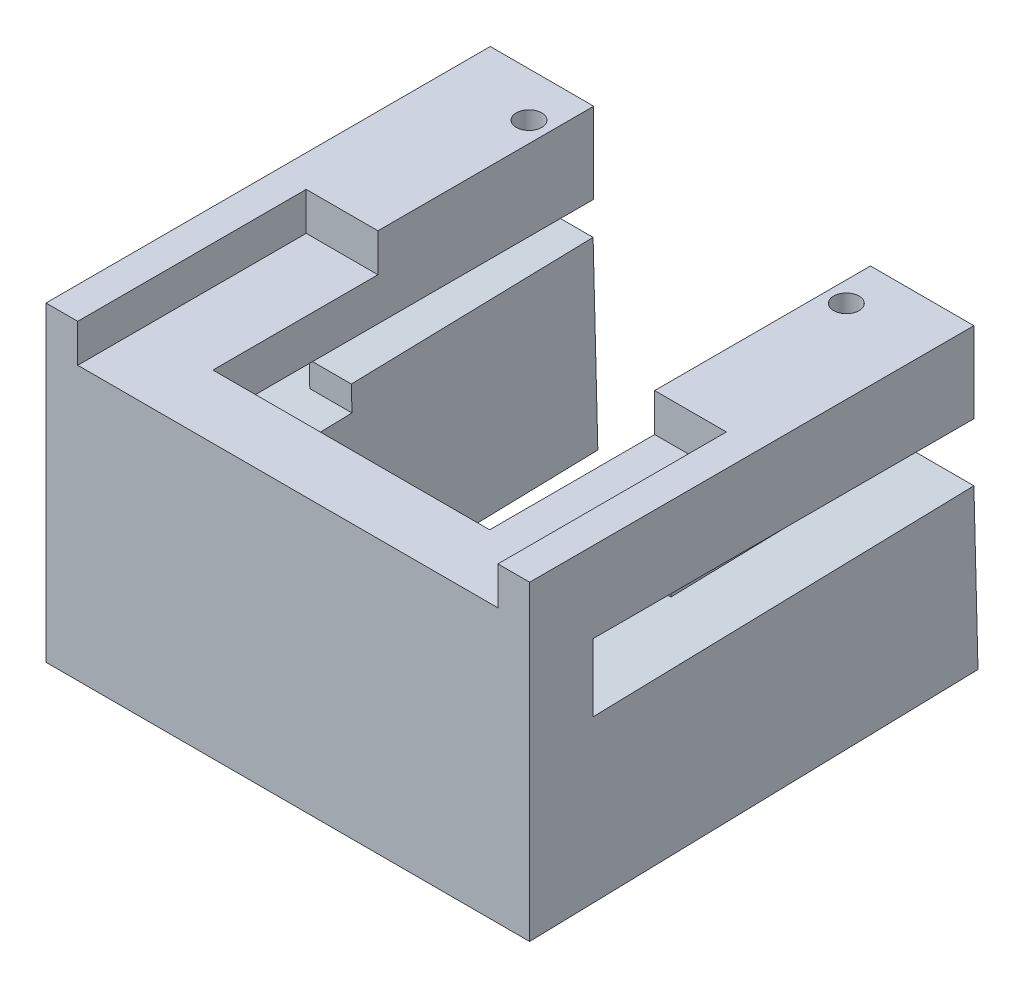
ISO-10303-21;
HEADER;
FILE_DESCRIPTION(('STEP AP214'),'2;1');
FILE_NAME('part.step','',(''),(''),'','','');
FILE_SCHEMA(('AUTOMOTIVE_DESIGN { 1 0 10303 214 1 1 1 1 }'));
ENDSEC;
DATA;
#1=APPLICATION_CONTEXT('core data for automotive mechanical design processes');
#2=APPLICATION_PROTOCOL_DEFINITION('international standard','automotive_design',2000,#1);
#3=PRODUCT_CONTEXT('',#1,'mechanical');
#4=PRODUCT('Part','Part','',(#3));
#5=PRODUCT_RELATED_PRODUCT_CATEGORY('part','',(#4));
#6=PRODUCT_DEFINITION_FORMATION('','',#4);
#7=PRODUCT_DEFINITION_CONTEXT('part definition',#1,'design');
#8=PRODUCT_DEFINITION('design','',#6,#7);
#9=PRODUCT_DEFINITION_SHAPE('','',#8);
#10=(LENGTH_UNIT() NAMED_UNIT(*) SI_UNIT(.MILLI.,.METRE.));
#11=(NAMED_UNIT(*) PLANE_ANGLE_UNIT() SI_UNIT($,.RADIAN.));
#12=(NAMED_UNIT(*) SI_UNIT($,.STERADIAN.) SOLID_ANGLE_UNIT());
#13=UNCERTAINTY_MEASURE_WITH_UNIT(LENGTH_MEASURE(1.E-05),#10,'distance_accuracy_value','');
#14=(GEOMETRIC_REPRESENTATION_CONTEXT(3) GLOBAL_UNCERTAINTY_ASSIGNED_CONTEXT((#13)) GLOBAL_UNIT_ASSIGNED_CONTEXT((#10,
#11,#12)) REPRESENTATION_CONTEXT('',''));
#15=CARTESIAN_POINT('',(0.,0.,0.));
#16=DIRECTION('',(0.,0.,1.));
#17=DIRECTION('',(1.,0.,0.));
#18=AXIS2_PLACEMENT_3D('',#15,#16,#17);
#19=CARTESIAN_POINT('',(19.05,7.40598079101419,0.));
#20=DIRECTION('',(0.,-1.,0.));
#21=DIRECTION('',(0.,0.,-1.));
#22=AXIS2_PLACEMENT_3D('',#19,#20,#21);
#23=PLANE('',#22);
#24=CARTESIAN_POINT('',(-12.5,7.40598079101419,-31.5));
#25=DIRECTION('',(0.,1.,0.));
#26=DIRECTION('',(0.,0.,1.));
#27=AXIS2_PLACEMENT_3D('',#24,#25,#26);
#28=CIRCLE('',#27,1.);
#29=CARTESIAN_POINT('',(-12.5,7.40598079101419,-30.5));
#30=VERTEX_POINT('',#29);
#31=EDGE_CURVE('E308',#30,#30,#28,.T.);
#32=ORIENTED_EDGE('',*,*,#31,.F.);
#33=EDGE_LOOP('',(#32));
#34=FACE_BOUND('',#33,.T.);
#35=DIRECTION('',(-1.,0.,0.));
#36=VECTOR('',#35,1.);
#37=CARTESIAN_POINT('',(19.05,7.40598079101419,0.));
#38=LINE('',#37,#36);
#39=CARTESIAN_POINT('',(-16.550005,7.40598079101419,0.));
#40=VERTEX_POINT('',#39);
#41=CARTESIAN_POINT('',(-19.05,7.40598079101419,0.));
#42=VERTEX_POINT('',#41);
#43=EDGE_CURVE('E413',#40,#42,#38,.T.);
#44=ORIENTED_EDGE('',*,*,#43,.F.);
#45=DIRECTION('',(0.,0.,1.));
#46=VECTOR('',#45,1.);
#47=CARTESIAN_POINT('',(-16.550005,7.40598079101419,-18.));
#48=LINE('',#47,#46);
#49=CARTESIAN_POINT('',(-16.550005,7.40598079101419,-18.));
#50=VERTEX_POINT('',#49);
#51=EDGE_CURVE('E269',#50,#40,#48,.T.);
#52=ORIENTED_EDGE('',*,*,#51,.F.);
#53=DIRECTION('',(-1.,0.,0.));
#54=VECTOR('',#53,1.);
#55=CARTESIAN_POINT('',(-16.550005,7.40598079101419,-18.));
#56=LINE('',#55,#54);
#57=CARTESIAN_POINT('',(-10.9000036,7.40598079101419,-18.));
#58=VERTEX_POINT('',#57);
#59=EDGE_CURVE('E289',#58,#50,#56,.T.);
#60=ORIENTED_EDGE('',*,*,#59,.F.);
#61=DIRECTION('',(0.,0.,1.));
#62=VECTOR('',#61,1.);
#63=CARTESIAN_POINT('',(-10.9000036,7.40598079101419,-37.9788415901854));
#64=LINE('',#63,#62);
#65=CARTESIAN_POINT('',(-10.9000036,7.40598079101419,-35.));
#66=VERTEX_POINT('',#65);
#67=EDGE_CURVE('E307',#66,#58,#64,.T.);
#68=ORIENTED_EDGE('',*,*,#67,.F.);
#69=DIRECTION('',(-1.,0.,0.));
#70=VECTOR('',#69,1.);
#71=CARTESIAN_POINT('',(19.05,7.40598079101419,-35.));
#72=LINE('',#71,#70);
#73=CARTESIAN_POINT('',(-19.05,7.40598079101419,-35.));
#74=VERTEX_POINT('',#73);
#75=EDGE_CURVE('E417',#66,#74,#72,.T.);
#76=ORIENTED_EDGE('',*,*,#75,.T.);
#77=DIRECTION('',(0.,0.,1.));
#78=VECTOR('',#77,1.);
#79=CARTESIAN_POINT('',(-19.05,7.40598079101419,0.));
#80=LINE('',#79,#78);
#81=EDGE_CURVE('E373',#74,#42,#80,.T.);
#82=ORIENTED_EDGE('',*,*,#81,.T.);
#83=EDGE_LOOP('',(#44,#52,#60,#68,#76,#82));
#84=FACE_BOUND('',#83,.T.);
#85=ADVANCED_FACE('F36',(#34,#84),#23,.F.);
#86=CARTESIAN_POINT('',(19.05,0.,-5.));
#87=DIRECTION('',(0.,0.,1.));
#88=DIRECTION('',(1.,0.,0.));
#89=AXIS2_PLACEMENT_3D('',#86,#87,#88);
#90=PLANE('',#89);
#91=DIRECTION('',(-1.,0.,0.));
#92=VECTOR('',#91,1.);
#93=CARTESIAN_POINT('',(19.05,4.40598079101419,-5.));
#94=LINE('',#93,#92);
#95=CARTESIAN_POINT('',(10.9000036,4.40598079101419,-5.));
#96=VERTEX_POINT('',#95);
#97=CARTESIAN_POINT('',(-10.9000036,4.40598079101419,-5.));
#98=VERTEX_POINT('',#97);
#99=EDGE_CURVE('E294',#96,#98,#94,.T.);
#100=ORIENTED_EDGE('',*,*,#99,.F.);
#101=DIRECTION('',(0.,1.,0.));
#102=VECTOR('',#101,1.);
#103=CARTESIAN_POINT('',(10.9000036,-17.1091153144315,-5.));
#104=LINE('',#103,#102);
#105=CARTESIAN_POINT('',(10.9000036,1.05598079101419,-5.));
#106=VERTEX_POINT('',#105);
#107=EDGE_CURVE('E321',#106,#96,#104,.T.);
#108=ORIENTED_EDGE('',*,*,#107,.F.);
#109=DIRECTION('',(-1.,0.,0.));
#110=VECTOR('',#109,1.);
#111=CARTESIAN_POINT('',(19.05,1.05598079101419,-5.));
#112=LINE('',#111,#110);
#113=CARTESIAN_POINT('',(19.05,1.05598079101419,-5.));
#114=VERTEX_POINT('',#113);
#115=EDGE_CURVE('E397',#114,#106,#112,.T.);
#116=ORIENTED_EDGE('',*,*,#115,.F.);
#117=DIRECTION('',(0.,1.,0.));
#118=VECTOR('',#117,1.);
#119=CARTESIAN_POINT('',(19.05,0.,-5.));
#120=LINE('',#119,#118);
#121=CARTESIAN_POINT('',(19.05,-4.27801920898581,-5.));
#122=VERTEX_POINT('',#121);
#123=EDGE_CURVE('E365',#122,#114,#120,.T.);
#124=ORIENTED_EDGE('',*,*,#123,.F.);
#125=DIRECTION('',(-1.,0.,0.));
#126=VECTOR('',#125,1.);
#127=CARTESIAN_POINT('',(19.05,-4.27801920898581,-5.));
#128=LINE('',#127,#126);
#129=CARTESIAN_POINT('',(10.9000036,-4.27801920898581,-5.));
#130=VERTEX_POINT('',#129);
#131=EDGE_CURVE('E401',#122,#130,#128,.T.);
#132=ORIENTED_EDGE('',*,*,#131,.T.);
#133=CARTESIAN_POINT('',(10.9000036,-16.9821153144315,-5.));
#134=VERTEX_POINT('',#133);
#135=EDGE_CURVE('E315',#134,#130,#104,.T.);
#136=ORIENTED_EDGE('',*,*,#135,.F.);
#137=DIRECTION('',(1.,0.,0.));
#138=VECTOR('',#137,1.);
#139=CARTESIAN_POINT('',(19.05,-16.9821153144315,-5.));
#140=LINE('',#139,#138);
#141=CARTESIAN_POINT('',(-10.9000036,-16.9821153144315,-5.));
#142=VERTEX_POINT('',#141);
#143=EDGE_CURVE('E311',#142,#134,#140,.T.);
#144=ORIENTED_EDGE('',*,*,#143,.F.);
#145=DIRECTION('',(0.,1.,0.));
#146=VECTOR('',#145,1.);
#147=CARTESIAN_POINT('',(-10.9000036,-17.1091153144315,-5.));
#148=LINE('',#147,#146);
#149=CARTESIAN_POINT('',(-10.9000036,-4.27801920898581,-5.));
#150=VERTEX_POINT('',#149);
#151=EDGE_CURVE('E324',#142,#150,#148,.T.);
#152=ORIENTED_EDGE('',*,*,#151,.T.);
#153=CARTESIAN_POINT('',(-19.05,-4.27801920898581,-5.));
#154=VERTEX_POINT('',#153);
#155=EDGE_CURVE('E400',#150,#154,#128,.T.);
#156=ORIENTED_EDGE('',*,*,#155,.T.);
#157=DIRECTION('',(0.,1.,0.));
#158=VECTOR('',#157,1.);
#159=CARTESIAN_POINT('',(-19.05,0.,-5.));
#160=LINE('',#159,#158);
#161=CARTESIAN_POINT('',(-19.05,1.05598079101419,-5.));
#162=VERTEX_POINT('',#161);
#163=EDGE_CURVE('E388',#154,#162,#160,.T.);
#164=ORIENTED_EDGE('',*,*,#163,.T.);
#165=CARTESIAN_POINT('',(-10.9000036,1.05598079101419,-5.));
#166=VERTEX_POINT('',#165);
#167=EDGE_CURVE('E396',#166,#162,#112,.T.);
#168=ORIENTED_EDGE('',*,*,#167,.F.);
#169=EDGE_CURVE('E320',#166,#98,#148,.T.);
#170=ORIENTED_EDGE('',*,*,#169,.T.);
#171=EDGE_LOOP('',(#100,#108,#116,#124,#132,#136,#144,#152,#156,#164,#168,#170));
#172=FACE_BOUND('',#171,.T.);
#173=ADVANCED_FACE('F459',(#172),#90,.F.);
#174=CARTESIAN_POINT('',(19.05,0.,-35.));
#175=DIRECTION('',(0.,0.,1.));
#176=DIRECTION('',(1.,0.,0.));
#177=AXIS2_PLACEMENT_3D('',#174,#175,#176);
#178=PLANE('',#177);
#179=ORIENTED_EDGE('',*,*,#75,.F.);
#180=DIRECTION('',(0.,-1.,0.));
#181=VECTOR('',#180,1.);
#182=CARTESIAN_POINT('',(-10.9000036,0.,-35.));
#183=LINE('',#182,#181);
#184=CARTESIAN_POINT('',(-10.9000036,1.05598079101419,-35.));
#185=VERTEX_POINT('',#184);
#186=EDGE_CURVE('E339',#66,#185,#183,.T.);
#187=ORIENTED_EDGE('',*,*,#186,.T.);
#188=DIRECTION('',(-1.,0.,0.));
#189=VECTOR('',#188,1.);
#190=CARTESIAN_POINT('',(19.05,1.05598079101419,-35.));
#191=LINE('',#190,#189);
#192=CARTESIAN_POINT('',(-19.05,1.05598079101419,-35.));
#193=VERTEX_POINT('',#192);
#194=EDGE_CURVE('E369',#185,#193,#191,.T.);
#195=ORIENTED_EDGE('',*,*,#194,.T.);
#196=DIRECTION('',(0.,1.,0.));
#197=VECTOR('',#196,1.);
#198=CARTESIAN_POINT('',(-19.05,0.,-35.));
#199=LINE('',#198,#197);
#200=EDGE_CURVE('E370',#193,#74,#199,.T.);
#201=ORIENTED_EDGE('',*,*,#200,.T.);
#202=EDGE_LOOP('',(#179,#187,#195,#201));
#203=FACE_BOUND('',#202,.T.);
#204=ADVANCED_FACE('F510',(#203),#178,.F.);
#205=CARTESIAN_POINT('',(19.05,0.886159890132452,-34.8881846508824));
#206=DIRECTION('',(0.,-0.0253918104304751,0.999677576002914));
#207=DIRECTION('',(0.,-0.999677576002915,-0.0253918104304752));
#208=AXIS2_PLACEMENT_3D('',#205,#206,#207);
#209=PLANE('',#208);
#210=DIRECTION('',(-1.,0.,0.));
#211=VECTOR('',#210,1.);
#212=CARTESIAN_POINT('',(19.05,-3.51601920898581,-35.));
#213=LINE('',#212,#211);
#214=CARTESIAN_POINT('',(-14.224,-3.51601920898581,-35.));
#215=VERTEX_POINT('',#214);
#216=CARTESIAN_POINT('',(-19.05,-3.51601920898581,-35.));
#217=VERTEX_POINT('',#216);
#218=EDGE_CURVE('E404',#215,#217,#213,.T.);
#219=ORIENTED_EDGE('',*,*,#218,.F.);
#220=DIRECTION('',(0.,0.999677576002914,0.025391810430474));
#221=VECTOR('',#220,1.);
#222=CARTESIAN_POINT('',(-14.224,-35.543513833746,-35.8134983634689));
#223=LINE('',#222,#221);
#224=CARTESIAN_POINT('',(-14.224,-1.51666405697998,-34.9492163791391));
#225=VERTEX_POINT('',#224);
#226=EDGE_CURVE('E243',#215,#225,#223,.T.);
#227=ORIENTED_EDGE('',*,*,#226,.T.);
#228=DIRECTION('',(-1.,0.,0.));
#229=VECTOR('',#228,1.);
#230=CARTESIAN_POINT('',(-14.224,-1.51666405697998,-34.9492163791391));
#231=LINE('',#230,#229);
#232=CARTESIAN_POINT('',(-10.9000036,-1.51666405697998,-34.9492163791391));
#233=VERTEX_POINT('',#232);
#234=EDGE_CURVE('E225',#233,#225,#231,.T.);
#235=ORIENTED_EDGE('',*,*,#234,.F.);
#236=DIRECTION('',(0.,-0.999677576002915,-0.0253918104304752));
#237=VECTOR('',#236,1.);
#238=CARTESIAN_POINT('',(-10.9000036,0.886159890132452,-34.8881846508824));
#239=LINE('',#238,#237);
#240=CARTESIAN_POINT('',(-10.9000036,-16.2119244242228,-35.322475992467));
#241=VERTEX_POINT('',#240);
#242=EDGE_CURVE('E345',#233,#241,#239,.T.);
#243=ORIENTED_EDGE('',*,*,#242,.T.);
#244=DIRECTION('',(-1.,0.,0.));
#245=VECTOR('',#244,1.);
#246=CARTESIAN_POINT('',(19.05,-16.2119244242228,-35.322475992467));
#247=LINE('',#246,#245);
#248=CARTESIAN_POINT('',(-19.05,-16.2119244242228,-35.322475992467));
#249=VERTEX_POINT('',#248);
#250=EDGE_CURVE('E407',#241,#249,#247,.T.);
#251=ORIENTED_EDGE('',*,*,#250,.T.);
#252=DIRECTION('',(0.,0.999677576002915,0.0253918104304752));
#253=VECTOR('',#252,1.);
#254=CARTESIAN_POINT('',(-19.05,0.886159890132452,-34.8881846508824));
#255=LINE('',#254,#253);
#256=EDGE_CURVE('E382',#249,#217,#255,.T.);
#257=ORIENTED_EDGE('',*,*,#256,.T.);
#258=EDGE_LOOP('',(#219,#227,#235,#243,#251,#257));
#259=FACE_BOUND('',#258,.T.);
#260=ADVANCED_FACE('F495',(#259),#209,.F.);
#261=CARTESIAN_POINT('',(19.05,-4.40217909911822,-0.111815349117603));
#262=DIRECTION('',(0.,-0.999677576002915,-0.025391810430474));
#263=DIRECTION('',(0.,0.025391810430474,-0.999677576002915));
#264=AXIS2_PLACEMENT_3D('',#261,#262,#263);
#265=PLANE('',#264);
#266=DIRECTION('',(-1.,0.,0.));
#267=VECTOR('',#266,1.);
#268=CARTESIAN_POINT('',(19.05,-3.99973319768634,-15.9561421771445));
#269=LINE('',#268,#267);
#270=CARTESIAN_POINT('',(-10.9000036,-3.99973319768634,-15.9561421771445));
#271=VERTEX_POINT('',#270);
#272=CARTESIAN_POINT('',(-14.224,-3.99973319768634,-15.9561421771445));
#273=VERTEX_POINT('',#272);
#274=EDGE_CURVE('E245',#271,#273,#269,.T.);
#275=ORIENTED_EDGE('',*,*,#274,.T.);
#276=DIRECTION('',(0.,0.025391810430474,-0.999677576002915));
#277=VECTOR('',#276,1.);
#278=CARTESIAN_POINT('',(-14.224,-4.40217909911822,-0.111815349117603));
#279=LINE('',#278,#277);
#280=EDGE_CURVE('E222',#273,#215,#279,.T.);
#281=ORIENTED_EDGE('',*,*,#280,.T.);
#282=ORIENTED_EDGE('',*,*,#218,.T.);
#283=DIRECTION('',(0.,-0.025391810430474,0.999677576002915));
#284=VECTOR('',#283,1.);
#285=CARTESIAN_POINT('',(-19.05,-4.40217909911822,-0.111815349117603));
#286=LINE('',#285,#284);
#287=EDGE_CURVE('E385',#217,#154,#286,.T.);
#288=ORIENTED_EDGE('',*,*,#287,.T.);
#289=ORIENTED_EDGE('',*,*,#155,.F.);
#290=DIRECTION('',(0.,0.025391810430474,-0.999677576002915));
#291=VECTOR('',#290,1.);
#292=CARTESIAN_POINT('',(-10.9000036,-4.40217909911822,-0.111815349117601));
#293=LINE('',#292,#291);
#294=EDGE_CURVE('E342',#150,#271,#293,.T.);
#295=ORIENTED_EDGE('',*,*,#294,.T.);
#296=EDGE_LOOP('',(#275,#281,#282,#288,#289,#295));
#297=FACE_BOUND('',#296,.T.);
#298=ADVANCED_FACE('F497',(#297),#265,.F.);
#299=CARTESIAN_POINT('',(19.05,1.05598079101419,0.));
#300=DIRECTION('',(0.,1.,0.));
#301=DIRECTION('',(0.,0.,1.));
#302=AXIS2_PLACEMENT_3D('',#299,#300,#301);
#303=PLANE('',#302);
#304=CARTESIAN_POINT('',(-12.5,1.05598079101419,-31.5));
#305=DIRECTION('',(0.,1.,0.));
#306=DIRECTION('',(0.,0.,1.));
#307=AXIS2_PLACEMENT_3D('',#304,#305,#306);
#308=CIRCLE('',#307,1.);
#309=CARTESIAN_POINT('',(-12.5,1.05598079101419,-30.5));
#310=VERTEX_POINT('',#309);
#311=EDGE_CURVE('E374',#310,#310,#308,.T.);
#312=ORIENTED_EDGE('',*,*,#311,.T.);
#313=EDGE_LOOP('',(#312));
#314=FACE_BOUND('',#313,.T.);
#315=ORIENTED_EDGE('',*,*,#194,.F.);
#316=DIRECTION('',(0.,0.,1.));
#317=VECTOR('',#316,1.);
#318=CARTESIAN_POINT('',(-10.9000036,1.05598079101419,0.));
#319=LINE('',#318,#317);
#320=EDGE_CURVE('E424',#185,#166,#319,.T.);
#321=ORIENTED_EDGE('',*,*,#320,.T.);
#322=ORIENTED_EDGE('',*,*,#167,.T.);
#323=DIRECTION('',(0.,0.,-1.));
#324=VECTOR('',#323,1.);
#325=CARTESIAN_POINT('',(-19.05,1.05598079101419,0.));
#326=LINE('',#325,#324);
#327=EDGE_CURVE('E355',#162,#193,#326,.T.);
#328=ORIENTED_EDGE('',*,*,#327,.T.);
#329=EDGE_LOOP('',(#315,#321,#322,#328));
#330=FACE_BOUND('',#329,.T.);
#331=ADVANCED_FACE('F508',(#314,#330),#303,.F.);
#332=CARTESIAN_POINT('',(19.05,1.05598079101419,-35.));
#333=VERTEX_POINT('',#332);
#334=CARTESIAN_POINT('',(10.9000036,1.05598079101419,-35.));
#335=VERTEX_POINT('',#334);
#336=EDGE_CURVE('E393',#333,#335,#191,.T.);
#337=ORIENTED_EDGE('',*,*,#336,.T.);
#338=DIRECTION('',(0.,1.,0.));
#339=VECTOR('',#338,1.);
#340=CARTESIAN_POINT('',(10.9000036,0.,-35.));
#341=LINE('',#340,#339);
#342=CARTESIAN_POINT('',(10.9000036,7.40598079101419,-35.));
#343=VERTEX_POINT('',#342);
#344=EDGE_CURVE('E329',#335,#343,#341,.T.);
#345=ORIENTED_EDGE('',*,*,#344,.T.);
#346=CARTESIAN_POINT('',(19.05,7.40598079101419,-35.));
#347=VERTEX_POINT('',#346);
#348=EDGE_CURVE('E418',#347,#343,#72,.T.);
#349=ORIENTED_EDGE('',*,*,#348,.F.);
#350=DIRECTION('',(0.,1.,0.));
#351=VECTOR('',#350,1.);
#352=CARTESIAN_POINT('',(19.05,0.,-35.));
#353=LINE('',#352,#351);
#354=EDGE_CURVE('E351',#333,#347,#353,.T.);
#355=ORIENTED_EDGE('',*,*,#354,.F.);
#356=EDGE_LOOP('',(#337,#345,#349,#355));
#357=FACE_BOUND('',#356,.T.);
#358=ADVANCED_FACE('F38',(#357),#178,.F.);
#359=CARTESIAN_POINT('',(12.5,7.40598079101419,-31.5));
#360=DIRECTION('',(0.,1.,0.));
#361=DIRECTION('',(0.,0.,1.));
#362=AXIS2_PLACEMENT_3D('',#359,#360,#361);
#363=CIRCLE('',#362,1.);
#364=CARTESIAN_POINT('',(12.5,7.40598079101419,-30.5));
#365=VERTEX_POINT('',#364);
#366=EDGE_CURVE('E312',#365,#365,#363,.T.);
#367=ORIENTED_EDGE('',*,*,#366,.F.);
#368=EDGE_LOOP('',(#367));
#369=FACE_BOUND('',#368,.T.);
#370=DIRECTION('',(0.,0.,-1.));
#371=VECTOR('',#370,1.);
#372=CARTESIAN_POINT('',(10.9000036,7.40598079101419,-37.9788415901854));
#373=LINE('',#372,#371);
#374=CARTESIAN_POINT('',(10.9000036,7.40598079101419,-18.));
#375=VERTEX_POINT('',#374);
#376=EDGE_CURVE('E318',#375,#343,#373,.T.);
#377=ORIENTED_EDGE('',*,*,#376,.F.);
#378=CARTESIAN_POINT('',(16.550005,7.40598079101419,-18.));
#379=VERTEX_POINT('',#378);
#380=EDGE_CURVE('E274',#379,#375,#56,.T.);
#381=ORIENTED_EDGE('',*,*,#380,.F.);
#382=DIRECTION('',(0.,0.,-1.));
#383=VECTOR('',#382,1.);
#384=CARTESIAN_POINT('',(16.550005,7.40598079101419,-18.));
#385=LINE('',#384,#383);
#386=CARTESIAN_POINT('',(16.550005,7.40598079101419,0.));
#387=VERTEX_POINT('',#386);
#388=EDGE_CURVE('E286',#387,#379,#385,.T.);
#389=ORIENTED_EDGE('',*,*,#388,.F.);
#390=CARTESIAN_POINT('',(19.05,7.40598079101419,0.));
#391=VERTEX_POINT('',#390);
#392=EDGE_CURVE('E414',#391,#387,#38,.T.);
#393=ORIENTED_EDGE('',*,*,#392,.F.);
#394=DIRECTION('',(0.,0.,1.));
#395=VECTOR('',#394,1.);
#396=CARTESIAN_POINT('',(19.05,7.40598079101419,0.));
#397=LINE('',#396,#395);
#398=EDGE_CURVE('E354',#347,#391,#397,.T.);
#399=ORIENTED_EDGE('',*,*,#398,.F.);
#400=ORIENTED_EDGE('',*,*,#348,.T.);
#401=EDGE_LOOP('',(#377,#381,#389,#393,#399,#400));
#402=FACE_BOUND('',#401,.T.);
#403=ADVANCED_FACE('F521',(#369,#402),#23,.F.);
#404=CARTESIAN_POINT('',(19.05,0.,0.));
#405=DIRECTION('',(0.,0.,-1.));
#406=DIRECTION('',(0.,1.,0.));
#407=AXIS2_PLACEMENT_3D('',#404,#405,#406);
#408=PLANE('',#407);
#409=DIRECTION('',(1.,0.,0.));
#410=VECTOR('',#409,1.);
#411=CARTESIAN_POINT('',(-16.550005,4.40598079101419,0.));
#412=LINE('',#411,#410);
#413=CARTESIAN_POINT('',(-16.550005,4.40598079101419,0.));
#414=VERTEX_POINT('',#413);
#415=CARTESIAN_POINT('',(16.550005,4.40598079101419,0.));
#416=VERTEX_POINT('',#415);
#417=EDGE_CURVE('E273',#414,#416,#412,.T.);
#418=ORIENTED_EDGE('',*,*,#417,.F.);
#419=DIRECTION('',(0.,1.,0.));
#420=VECTOR('',#419,1.);
#421=CARTESIAN_POINT('',(-16.550005,4.40598079101419,0.));
#422=LINE('',#421,#420);
#423=EDGE_CURVE('E284',#414,#40,#422,.T.);
#424=ORIENTED_EDGE('',*,*,#423,.T.);
#425=ORIENTED_EDGE('',*,*,#43,.T.);
#426=DIRECTION('',(0.,-1.,0.));
#427=VECTOR('',#426,1.);
#428=CARTESIAN_POINT('',(-19.05,0.,0.));
#429=LINE('',#428,#427);
#430=CARTESIAN_POINT('',(-19.05,-17.1091153144315,0.));
#431=VERTEX_POINT('',#430);
#432=EDGE_CURVE('E377',#42,#431,#429,.T.);
#433=ORIENTED_EDGE('',*,*,#432,.T.);
#434=DIRECTION('',(-1.,0.,0.));
#435=VECTOR('',#434,1.);
#436=CARTESIAN_POINT('',(19.05,-17.1091153144315,0.));
#437=LINE('',#436,#435);
#438=CARTESIAN_POINT('',(19.05,-17.1091153144315,0.));
#439=VERTEX_POINT('',#438);
#440=EDGE_CURVE('E410',#439,#431,#437,.T.);
#441=ORIENTED_EDGE('',*,*,#440,.F.);
#442=DIRECTION('',(0.,-1.,0.));
#443=VECTOR('',#442,1.);
#444=CARTESIAN_POINT('',(19.05,0.,0.));
#445=LINE('',#444,#443);
#446=EDGE_CURVE('E357',#391,#439,#445,.T.);
#447=ORIENTED_EDGE('',*,*,#446,.F.);
#448=ORIENTED_EDGE('',*,*,#392,.T.);
#449=DIRECTION('',(0.,1.,0.));
#450=VECTOR('',#449,1.);
#451=CARTESIAN_POINT('',(16.550005,4.40598079101419,0.));
#452=LINE('',#451,#450);
#453=EDGE_CURVE('E297',#416,#387,#452,.T.);
#454=ORIENTED_EDGE('',*,*,#453,.F.);
#455=EDGE_LOOP('',(#418,#424,#425,#433,#441,#447,#448,#454));
#456=FACE_BOUND('',#455,.T.);
#457=ADVANCED_FACE('F451',(#456),#408,.F.);
#458=CARTESIAN_POINT('',(19.05,-17.0980843143552,-0.434291341584623));
#459=DIRECTION('',(0.,0.999677576002915,0.025391810430474));
#460=DIRECTION('',(0.,-0.025391810430474,0.999677576002915));
#461=AXIS2_PLACEMENT_3D('',#458,#459,#460);
#462=PLANE('',#461);
#463=DIRECTION('',(0.,0.025391810430474,-0.999677576002915));
#464=VECTOR('',#463,1.);
#465=CARTESIAN_POINT('',(-19.05,-17.0980843143552,-0.434291341584623));
#466=LINE('',#465,#464);
#467=EDGE_CURVE('E379',#431,#249,#466,.T.);
#468=ORIENTED_EDGE('',*,*,#467,.T.);
#469=ORIENTED_EDGE('',*,*,#250,.F.);
#470=DIRECTION('',(0.,-0.025391810430474,0.999677576002915));
#471=VECTOR('',#470,1.);
#472=CARTESIAN_POINT('',(-10.9000036,-17.0980843143552,-0.434291341584622));
#473=LINE('',#472,#471);
#474=EDGE_CURVE('E348',#241,#142,#473,.T.);
#475=ORIENTED_EDGE('',*,*,#474,.T.);
#476=ORIENTED_EDGE('',*,*,#143,.T.);
#477=DIRECTION('',(0.,0.025391810430474,-0.999677576002915));
#478=VECTOR('',#477,1.);
#479=CARTESIAN_POINT('',(10.9000036,-17.0980843143552,-0.434291341584624));
#480=LINE('',#479,#478);
#481=CARTESIAN_POINT('',(10.9000036,-16.2119244242228,-35.322475992467));
#482=VERTEX_POINT('',#481);
#483=EDGE_CURVE('E336',#134,#482,#480,.T.);
#484=ORIENTED_EDGE('',*,*,#483,.T.);
#485=CARTESIAN_POINT('',(19.05,-16.2119244242228,-35.322475992467));
#486=VERTEX_POINT('',#485);
#487=EDGE_CURVE('E408',#486,#482,#247,.T.);
#488=ORIENTED_EDGE('',*,*,#487,.F.);
#489=DIRECTION('',(0.,0.025391810430474,-0.999677576002915));
#490=VECTOR('',#489,1.);
#491=CARTESIAN_POINT('',(19.05,-17.0980843143552,-0.434291341584623));
#492=LINE('',#491,#490);
#493=EDGE_CURVE('E359',#439,#486,#492,.T.);
#494=ORIENTED_EDGE('',*,*,#493,.F.);
#495=ORIENTED_EDGE('',*,*,#440,.T.);
#496=EDGE_LOOP('',(#468,#469,#475,#476,#484,#488,#494,#495));
#497=FACE_BOUND('',#496,.T.);
#498=ADVANCED_FACE('F487',(#497),#462,.F.);
#499=ORIENTED_EDGE('',*,*,#487,.T.);
#500=DIRECTION('',(0.,0.999677576002915,0.0253918104304752));
#501=VECTOR('',#500,1.);
#502=CARTESIAN_POINT('',(10.9000036,0.886159890132452,-34.8881846508824));
#503=LINE('',#502,#501);
#504=CARTESIAN_POINT('',(10.9000036,-1.51666405697998,-34.9492163791391));
#505=VERTEX_POINT('',#504);
#506=EDGE_CURVE('E334',#482,#505,#503,.T.);
#507=ORIENTED_EDGE('',*,*,#506,.T.);
#508=DIRECTION('',(-1.,0.,0.));
#509=VECTOR('',#508,1.);
#510=CARTESIAN_POINT('',(14.224,-1.51666405697998,-34.9492163791391));
#511=LINE('',#510,#509);
#512=CARTESIAN_POINT('',(14.224,-1.51666405697998,-34.9492163791391));
#513=VERTEX_POINT('',#512);
#514=EDGE_CURVE('E252',#513,#505,#511,.T.);
#515=ORIENTED_EDGE('',*,*,#514,.F.);
#516=DIRECTION('',(0.,0.999677576002914,0.025391810430474));
#517=VECTOR('',#516,1.);
#518=CARTESIAN_POINT('',(14.224,-35.543513833746,-35.8134983634689));
#519=LINE('',#518,#517);
#520=CARTESIAN_POINT('',(14.224,-3.51601920898581,-35.));
#521=VERTEX_POINT('',#520);
#522=EDGE_CURVE('E261',#521,#513,#519,.T.);
#523=ORIENTED_EDGE('',*,*,#522,.F.);
#524=CARTESIAN_POINT('',(19.05,-3.51601920898581,-35.));
#525=VERTEX_POINT('',#524);
#526=EDGE_CURVE('E405',#525,#521,#213,.T.);
#527=ORIENTED_EDGE('',*,*,#526,.F.);
#528=DIRECTION('',(0.,0.999677576002915,0.0253918104304752));
#529=VECTOR('',#528,1.);
#530=CARTESIAN_POINT('',(19.05,0.886159890132452,-34.8881846508824));
#531=LINE('',#530,#529);
#532=EDGE_CURVE('E361',#486,#525,#531,.T.);
#533=ORIENTED_EDGE('',*,*,#532,.F.);
#534=EDGE_LOOP('',(#499,#507,#515,#523,#527,#533));
#535=FACE_BOUND('',#534,.T.);
#536=ADVANCED_FACE('F551',(#535),#209,.F.);
#537=ORIENTED_EDGE('',*,*,#526,.T.);
#538=DIRECTION('',(0.,-0.025391810430474,0.999677576002915));
#539=VECTOR('',#538,1.);
#540=CARTESIAN_POINT('',(14.224,-4.40217909911822,-0.111815349117603));
#541=LINE('',#540,#539);
#542=CARTESIAN_POINT('',(14.224,-3.99973319768634,-15.9561421771445));
#543=VERTEX_POINT('',#542);
#544=EDGE_CURVE('E11',#521,#543,#541,.T.);
#545=ORIENTED_EDGE('',*,*,#544,.T.);
#546=DIRECTION('',(-1.,0.,0.));
#547=VECTOR('',#546,1.);
#548=CARTESIAN_POINT('',(19.05,-3.99973319768634,-15.9561421771445));
#549=LINE('',#548,#547);
#550=CARTESIAN_POINT('',(10.9000036,-3.99973319768634,-15.9561421771445));
#551=VERTEX_POINT('',#550);
#552=EDGE_CURVE('E264',#543,#551,#549,.T.);
#553=ORIENTED_EDGE('',*,*,#552,.T.);
#554=DIRECTION('',(0.,-0.025391810430474,0.999677576002915));
#555=VECTOR('',#554,1.);
#556=CARTESIAN_POINT('',(10.9000036,-4.40217909911822,-0.111815349117603));
#557=LINE('',#556,#555);
#558=EDGE_CURVE('E332',#551,#130,#557,.T.);
#559=ORIENTED_EDGE('',*,*,#558,.T.);
#560=ORIENTED_EDGE('',*,*,#131,.F.);
#561=DIRECTION('',(0.,-0.025391810430474,0.999677576002915));
#562=VECTOR('',#561,1.);
#563=CARTESIAN_POINT('',(19.05,-4.40217909911822,-0.111815349117603));
#564=LINE('',#563,#562);
#565=EDGE_CURVE('E363',#525,#122,#564,.T.);
#566=ORIENTED_EDGE('',*,*,#565,.F.);
#567=EDGE_LOOP('',(#537,#545,#553,#559,#560,#566));
#568=FACE_BOUND('',#567,.T.);
#569=ADVANCED_FACE('F477',(#568),#265,.F.);
#570=CARTESIAN_POINT('',(12.5,1.05598079101419,-31.5));
#571=DIRECTION('',(0.,1.,0.));
#572=DIRECTION('',(0.,0.,1.));
#573=AXIS2_PLACEMENT_3D('',#570,#571,#572);
#574=CIRCLE('',#573,1.);
#575=CARTESIAN_POINT('',(12.5,1.05598079101419,-30.5));
#576=VERTEX_POINT('',#575);
#577=EDGE_CURVE('E350',#576,#576,#574,.T.);
#578=ORIENTED_EDGE('',*,*,#577,.T.);
#579=EDGE_LOOP('',(#578));
#580=FACE_BOUND('',#579,.T.);
#581=ORIENTED_EDGE('',*,*,#115,.T.);
#582=DIRECTION('',(0.,0.,-1.));
#583=VECTOR('',#582,1.);
#584=CARTESIAN_POINT('',(10.9000036,1.05598079101419,0.));
#585=LINE('',#584,#583);
#586=EDGE_CURVE('E421',#106,#335,#585,.T.);
#587=ORIENTED_EDGE('',*,*,#586,.T.);
#588=ORIENTED_EDGE('',*,*,#336,.F.);
#589=DIRECTION('',(0.,0.,-1.));
#590=VECTOR('',#589,1.);
#591=CARTESIAN_POINT('',(19.05,1.05598079101419,0.));
#592=LINE('',#591,#590);
#593=EDGE_CURVE('E367',#114,#333,#592,.T.);
#594=ORIENTED_EDGE('',*,*,#593,.F.);
#595=EDGE_LOOP('',(#581,#587,#588,#594));
#596=FACE_BOUND('',#595,.T.);
#597=ADVANCED_FACE('F468',(#580,#596),#303,.F.);
#598=CARTESIAN_POINT('',(19.05,0.,0.));
#599=DIRECTION('',(1.,0.,0.));
#600=DIRECTION('',(0.,0.,-1.));
#601=AXIS2_PLACEMENT_3D('',#598,#599,#600);
#602=PLANE('',#601);
#603=ORIENTED_EDGE('',*,*,#354,.T.);
#604=ORIENTED_EDGE('',*,*,#398,.T.);
#605=ORIENTED_EDGE('',*,*,#446,.T.);
#606=ORIENTED_EDGE('',*,*,#493,.T.);
#607=ORIENTED_EDGE('',*,*,#532,.T.);
#608=ORIENTED_EDGE('',*,*,#565,.T.);
#609=ORIENTED_EDGE('',*,*,#123,.T.);
#610=ORIENTED_EDGE('',*,*,#593,.T.);
#611=EDGE_LOOP('',(#603,#604,#605,#606,#607,#608,#609,#610));
#612=FACE_BOUND('',#611,.T.);
#613=ADVANCED_FACE('F473',(#612),#602,.T.);
#614=CARTESIAN_POINT('',(-19.05,0.,0.));
#615=DIRECTION('',(1.,0.,0.));
#616=DIRECTION('',(0.,0.,-1.));
#617=AXIS2_PLACEMENT_3D('',#614,#615,#616);
#618=PLANE('',#617);
#619=ORIENTED_EDGE('',*,*,#200,.F.);
#620=ORIENTED_EDGE('',*,*,#327,.F.);
#621=ORIENTED_EDGE('',*,*,#163,.F.);
#622=ORIENTED_EDGE('',*,*,#287,.F.);
#623=ORIENTED_EDGE('',*,*,#256,.F.);
#624=ORIENTED_EDGE('',*,*,#467,.F.);
#625=ORIENTED_EDGE('',*,*,#432,.F.);
#626=ORIENTED_EDGE('',*,*,#81,.F.);
#627=EDGE_LOOP('',(#619,#620,#621,#622,#623,#624,#625,#626));
#628=FACE_BOUND('',#627,.T.);
#629=ADVANCED_FACE('F504',(#628),#618,.F.);
#630=CARTESIAN_POINT('',(10.9000036,-17.1091153144315,-37.9788415901854));
#631=DIRECTION('',(1.,0.,0.));
#632=DIRECTION('',(0.,0.,-1.));
#633=AXIS2_PLACEMENT_3D('',#630,#631,#632);
#634=PLANE('',#633);
#635=DIRECTION('',(0.,0.,1.));
#636=VECTOR('',#635,1.);
#637=CARTESIAN_POINT('',(10.9000036,4.40598079101419,-37.9788415901854));
#638=LINE('',#637,#636);
#639=CARTESIAN_POINT('',(10.9000036,4.40598079101419,-18.));
#640=VERTEX_POINT('',#639);
#641=EDGE_CURVE('E302',#640,#96,#638,.T.);
#642=ORIENTED_EDGE('',*,*,#641,.F.);
#643=DIRECTION('',(0.,1.,0.));
#644=VECTOR('',#643,1.);
#645=CARTESIAN_POINT('',(10.9000036,-17.1091153144315,-18.));
#646=LINE('',#645,#644);
#647=EDGE_CURVE('E304',#640,#375,#646,.T.);
#648=ORIENTED_EDGE('',*,*,#647,.T.);
#649=ORIENTED_EDGE('',*,*,#376,.T.);
#650=ORIENTED_EDGE('',*,*,#344,.F.);
#651=ORIENTED_EDGE('',*,*,#586,.F.);
#652=ORIENTED_EDGE('',*,*,#107,.T.);
#653=EDGE_LOOP('',(#642,#648,#649,#650,#651,#652));
#654=FACE_BOUND('',#653,.T.);
#655=ADVANCED_FACE('F464',(#654),#634,.F.);
#656=CARTESIAN_POINT('',(-10.9000036,-17.1091153144315,-37.9788415901854));
#657=DIRECTION('',(-1.,0.,0.));
#658=DIRECTION('',(0.,0.,1.));
#659=AXIS2_PLACEMENT_3D('',#656,#657,#658);
#660=PLANE('',#659);
#661=ORIENTED_EDGE('',*,*,#67,.T.);
#662=DIRECTION('',(0.,-1.,0.));
#663=VECTOR('',#662,1.);
#664=CARTESIAN_POINT('',(-10.9000036,-17.1091153144315,-18.));
#665=LINE('',#664,#663);
#666=CARTESIAN_POINT('',(-10.9000036,4.40598079101419,-18.));
#667=VERTEX_POINT('',#666);
#668=EDGE_CURVE('E44',#58,#667,#665,.T.);
#669=ORIENTED_EDGE('',*,*,#668,.T.);
#670=DIRECTION('',(0.,0.,-1.));
#671=VECTOR('',#670,1.);
#672=CARTESIAN_POINT('',(-10.9000036,4.40598079101419,-37.9788415901854));
#673=LINE('',#672,#671);
#674=EDGE_CURVE('E427',#98,#667,#673,.T.);
#675=ORIENTED_EDGE('',*,*,#674,.F.);
#676=ORIENTED_EDGE('',*,*,#169,.F.);
#677=ORIENTED_EDGE('',*,*,#320,.F.);
#678=ORIENTED_EDGE('',*,*,#186,.F.);
#679=EDGE_LOOP('',(#661,#669,#675,#676,#677,#678));
#680=FACE_BOUND('',#679,.T.);
#681=ADVANCED_FACE('F435',(#680),#660,.F.);
#682=CARTESIAN_POINT('',(12.5,-17.1091153144315,-31.5));
#683=DIRECTION('',(0.,1.,0.));
#684=DIRECTION('',(0.,0.,1.));
#685=AXIS2_PLACEMENT_3D('',#682,#683,#684);
#686=CYLINDRICAL_SURFACE('',#685,1.);
#687=ORIENTED_EDGE('',*,*,#366,.T.);
#688=EDGE_LOOP('',(#687));
#689=FACE_BOUND('',#688,.T.);
#690=ORIENTED_EDGE('',*,*,#577,.F.);
#691=EDGE_LOOP('',(#690));
#692=FACE_BOUND('',#691,.T.);
#693=ADVANCED_FACE('F568',(#689,#692),#686,.F.);
#694=CARTESIAN_POINT('',(-12.5,-17.1091153144315,-31.5));
#695=DIRECTION('',(0.,1.,0.));
#696=DIRECTION('',(0.,0.,1.));
#697=AXIS2_PLACEMENT_3D('',#694,#695,#696);
#698=CYLINDRICAL_SURFACE('',#697,1.);
#699=ORIENTED_EDGE('',*,*,#31,.T.);
#700=EDGE_LOOP('',(#699));
#701=FACE_BOUND('',#700,.T.);
#702=ORIENTED_EDGE('',*,*,#311,.F.);
#703=EDGE_LOOP('',(#702));
#704=FACE_BOUND('',#703,.T.);
#705=ADVANCED_FACE('F565',(#701,#704),#698,.F.);
#706=ORIENTED_EDGE('',*,*,#151,.F.);
#707=ORIENTED_EDGE('',*,*,#474,.F.);
#708=ORIENTED_EDGE('',*,*,#242,.F.);
#709=DIRECTION('',(0.,0.025391810430474,-0.999677576002914));
#710=VECTOR('',#709,1.);
#711=CARTESIAN_POINT('',(-10.9000036,-2.00037804568051,-15.9053585562835));
#712=LINE('',#711,#710);
#713=CARTESIAN_POINT('',(-10.9000036,-2.00037804568051,-15.9053585562835));
#714=VERTEX_POINT('',#713);
#715=EDGE_CURVE('E234',#714,#233,#712,.T.);
#716=ORIENTED_EDGE('',*,*,#715,.F.);
#717=DIRECTION('',(0.,0.999677576002914,0.025391810430474));
#718=VECTOR('',#717,1.);
#719=CARTESIAN_POINT('',(-10.9000036,-36.0272278224465,-16.7696405406134));
#720=LINE('',#719,#718);
#721=EDGE_CURVE('E224',#271,#714,#720,.T.);
#722=ORIENTED_EDGE('',*,*,#721,.F.);
#723=ORIENTED_EDGE('',*,*,#294,.F.);
#724=EDGE_LOOP('',(#706,#707,#708,#716,#722,#723));
#725=FACE_BOUND('',#724,.T.);
#726=ADVANCED_FACE('F491',(#725),#660,.F.);
#727=ORIENTED_EDGE('',*,*,#558,.F.);
#728=DIRECTION('',(0.,0.999677576002914,0.025391810430474));
#729=VECTOR('',#728,1.);
#730=CARTESIAN_POINT('',(10.9000036,-36.0272278224465,-16.7696405406134));
#731=LINE('',#730,#729);
#732=CARTESIAN_POINT('',(10.9000036,-2.00037804568051,-15.9053585562835));
#733=VERTEX_POINT('',#732);
#734=EDGE_CURVE('E265',#551,#733,#731,.T.);
#735=ORIENTED_EDGE('',*,*,#734,.T.);
#736=DIRECTION('',(0.,-0.025391810430474,0.999677576002914));
#737=VECTOR('',#736,1.);
#738=CARTESIAN_POINT('',(10.9000036,-1.51666405697998,-34.9492163791391));
#739=LINE('',#738,#737);
#740=EDGE_CURVE('E255',#505,#733,#739,.T.);
#741=ORIENTED_EDGE('',*,*,#740,.F.);
#742=ORIENTED_EDGE('',*,*,#506,.F.);
#743=ORIENTED_EDGE('',*,*,#483,.F.);
#744=ORIENTED_EDGE('',*,*,#135,.T.);
#745=EDGE_LOOP('',(#727,#735,#741,#742,#743,#744));
#746=FACE_BOUND('',#745,.T.);
#747=ADVANCED_FACE('F482',(#746),#634,.F.);
#748=CARTESIAN_POINT('',(-16.550005,4.40598079101419,-18.));
#749=DIRECTION('',(0.,0.,-1.));
#750=DIRECTION('',(-1.,0.,0.));
#751=AXIS2_PLACEMENT_3D('',#748,#749,#750);
#752=PLANE('',#751);
#753=DIRECTION('',(-1.,0.,0.));
#754=VECTOR('',#753,1.);
#755=CARTESIAN_POINT('',(-16.550005,4.40598079101419,-18.));
#756=LINE('',#755,#754);
#757=CARTESIAN_POINT('',(16.550005,4.40598079101419,-18.));
#758=VERTEX_POINT('',#757);
#759=EDGE_CURVE('E281',#758,#640,#756,.T.);
#760=ORIENTED_EDGE('',*,*,#759,.F.);
#761=DIRECTION('',(0.,1.,0.));
#762=VECTOR('',#761,1.);
#763=CARTESIAN_POINT('',(16.550005,4.40598079101419,-18.));
#764=LINE('',#763,#762);
#765=EDGE_CURVE('E295',#758,#379,#764,.T.);
#766=ORIENTED_EDGE('',*,*,#765,.T.);
#767=ORIENTED_EDGE('',*,*,#380,.T.);
#768=ORIENTED_EDGE('',*,*,#647,.F.);
#769=EDGE_LOOP('',(#760,#766,#767,#768));
#770=FACE_BOUND('',#769,.T.);
#771=ADVANCED_FACE('F526',(#770),#752,.F.);
#772=ORIENTED_EDGE('',*,*,#59,.T.);
#773=DIRECTION('',(0.,1.,0.));
#774=VECTOR('',#773,1.);
#775=CARTESIAN_POINT('',(-16.550005,4.40598079101419,-18.));
#776=LINE('',#775,#774);
#777=CARTESIAN_POINT('',(-16.550005,4.40598079101419,-18.));
#778=VERTEX_POINT('',#777);
#779=EDGE_CURVE('E291',#778,#50,#776,.T.);
#780=ORIENTED_EDGE('',*,*,#779,.F.);
#781=EDGE_CURVE('E280',#667,#778,#756,.T.);
#782=ORIENTED_EDGE('',*,*,#781,.F.);
#783=ORIENTED_EDGE('',*,*,#668,.F.);
#784=EDGE_LOOP('',(#772,#780,#782,#783));
#785=FACE_BOUND('',#784,.T.);
#786=ADVANCED_FACE('F440',(#785),#752,.F.);
#787=CARTESIAN_POINT('',(0.,4.40598079101419,0.));
#788=DIRECTION('',(0.,1.,0.));
#789=DIRECTION('',(0.,0.,1.));
#790=AXIS2_PLACEMENT_3D('',#787,#788,#789);
#791=PLANE('',#790);
#792=ORIENTED_EDGE('',*,*,#641,.T.);
#793=ORIENTED_EDGE('',*,*,#99,.T.);
#794=ORIENTED_EDGE('',*,*,#674,.T.);
#795=ORIENTED_EDGE('',*,*,#781,.T.);
#796=DIRECTION('',(0.,0.,1.));
#797=VECTOR('',#796,1.);
#798=CARTESIAN_POINT('',(-16.550005,4.40598079101419,-18.));
#799=LINE('',#798,#797);
#800=EDGE_CURVE('E270',#778,#414,#799,.T.);
#801=ORIENTED_EDGE('',*,*,#800,.T.);
#802=ORIENTED_EDGE('',*,*,#417,.T.);
#803=DIRECTION('',(0.,0.,-1.));
#804=VECTOR('',#803,1.);
#805=CARTESIAN_POINT('',(16.550005,4.40598079101419,-18.));
#806=LINE('',#805,#804);
#807=EDGE_CURVE('E277',#416,#758,#806,.T.);
#808=ORIENTED_EDGE('',*,*,#807,.T.);
#809=ORIENTED_EDGE('',*,*,#759,.T.);
#810=EDGE_LOOP('',(#792,#793,#794,#795,#801,#802,#808,#809));
#811=FACE_BOUND('',#810,.T.);
#812=ADVANCED_FACE('F454',(#811),#791,.T.);
#813=CARTESIAN_POINT('',(-16.550005,4.40598079101419,-18.));
#814=DIRECTION('',(-1.,0.,0.));
#815=DIRECTION('',(0.,0.,1.));
#816=AXIS2_PLACEMENT_3D('',#813,#814,#815);
#817=PLANE('',#816);
#818=ORIENTED_EDGE('',*,*,#51,.T.);
#819=ORIENTED_EDGE('',*,*,#423,.F.);
#820=ORIENTED_EDGE('',*,*,#800,.F.);
#821=ORIENTED_EDGE('',*,*,#779,.T.);
#822=EDGE_LOOP('',(#818,#819,#820,#821));
#823=FACE_BOUND('',#822,.T.);
#824=ADVANCED_FACE('F447',(#823),#817,.F.);
#825=CARTESIAN_POINT('',(16.550005,4.40598079101419,-18.));
#826=DIRECTION('',(1.,0.,0.));
#827=DIRECTION('',(0.,0.,-1.));
#828=AXIS2_PLACEMENT_3D('',#825,#826,#827);
#829=PLANE('',#828);
#830=ORIENTED_EDGE('',*,*,#388,.T.);
#831=ORIENTED_EDGE('',*,*,#765,.F.);
#832=ORIENTED_EDGE('',*,*,#807,.F.);
#833=ORIENTED_EDGE('',*,*,#453,.T.);
#834=EDGE_LOOP('',(#830,#831,#832,#833));
#835=FACE_BOUND('',#834,.T.);
#836=ADVANCED_FACE('F524',(#835),#829,.F.);
#837=CARTESIAN_POINT('',(14.224,-35.543513833746,-35.8134983634689));
#838=DIRECTION('',(1.,0.,0.));
#839=DIRECTION('',(0.,0.,-1.));
#840=AXIS2_PLACEMENT_3D('',#837,#838,#839);
#841=PLANE('',#840);
#842=ORIENTED_EDGE('',*,*,#544,.F.);
#843=ORIENTED_EDGE('',*,*,#522,.T.);
#844=DIRECTION('',(0.,0.025391810430474,-0.999677576002915));
#845=VECTOR('',#844,1.);
#846=CARTESIAN_POINT('',(14.224,-1.51666405697998,-34.9492163791391));
#847=LINE('',#846,#845);
#848=CARTESIAN_POINT('',(14.224,-2.00037804568051,-15.9053585562835));
#849=VERTEX_POINT('',#848);
#850=EDGE_CURVE('E249',#849,#513,#847,.T.);
#851=ORIENTED_EDGE('',*,*,#850,.F.);
#852=DIRECTION('',(0.,0.999677576002914,0.025391810430474));
#853=VECTOR('',#852,1.);
#854=CARTESIAN_POINT('',(14.224,-36.0272278224465,-16.7696405406134));
#855=LINE('',#854,#853);
#856=EDGE_CURVE('E262',#543,#849,#855,.T.);
#857=ORIENTED_EDGE('',*,*,#856,.F.);
#858=EDGE_LOOP('',(#842,#843,#851,#857));
#859=FACE_BOUND('',#858,.T.);
#860=ADVANCED_FACE('F579',(#859),#841,.T.);
#861=CARTESIAN_POINT('',(14.224,-36.0272278224465,-16.7696405406134));
#862=DIRECTION('',(0.,-0.025391810430474,0.999677576002914));
#863=DIRECTION('',(0.,-0.999677576002915,-0.025391810430474));
#864=AXIS2_PLACEMENT_3D('',#861,#862,#863);
#865=PLANE('',#864);
#866=ORIENTED_EDGE('',*,*,#552,.F.);
#867=ORIENTED_EDGE('',*,*,#856,.T.);
#868=DIRECTION('',(1.,0.,0.));
#869=VECTOR('',#868,1.);
#870=CARTESIAN_POINT('',(14.224,-2.00037804568051,-15.9053585562835));
#871=LINE('',#870,#869);
#872=EDGE_CURVE('E258',#733,#849,#871,.T.);
#873=ORIENTED_EDGE('',*,*,#872,.F.);
#874=ORIENTED_EDGE('',*,*,#734,.F.);
#875=EDGE_LOOP('',(#866,#867,#873,#874));
#876=FACE_BOUND('',#875,.T.);
#877=ADVANCED_FACE('F586',(#876),#865,.T.);
#878=CARTESIAN_POINT('',(0.,-2.40282394711239,-0.0610317282566547));
#879=DIRECTION('',(0.,-0.999677576002915,-0.025391810430474));
#880=DIRECTION('',(0.,0.025391810430474,-0.999677576002915));
#881=AXIS2_PLACEMENT_3D('',#878,#879,#880);
#882=PLANE('',#881);
#883=ORIENTED_EDGE('',*,*,#850,.T.);
#884=ORIENTED_EDGE('',*,*,#514,.T.);
#885=ORIENTED_EDGE('',*,*,#740,.T.);
#886=ORIENTED_EDGE('',*,*,#872,.T.);
#887=EDGE_LOOP('',(#883,#884,#885,#886));
#888=FACE_BOUND('',#887,.T.);
#889=ADVANCED_FACE('F590',(#888),#882,.F.);
#890=CARTESIAN_POINT('',(-14.224,-36.0272278224465,-16.7696405406134));
#891=DIRECTION('',(-1.,0.,0.));
#892=DIRECTION('',(0.,0.,1.));
#893=AXIS2_PLACEMENT_3D('',#890,#891,#892);
#894=PLANE('',#893);
#895=ORIENTED_EDGE('',*,*,#280,.F.);
#896=DIRECTION('',(0.,0.999677576002914,0.025391810430474));
#897=VECTOR('',#896,1.);
#898=CARTESIAN_POINT('',(-14.224,-36.0272278224465,-16.7696405406134));
#899=LINE('',#898,#897);
#900=CARTESIAN_POINT('',(-14.224,-2.00037804568051,-15.9053585562835));
#901=VERTEX_POINT('',#900);
#902=EDGE_CURVE('E51',#273,#901,#899,.T.);
#903=ORIENTED_EDGE('',*,*,#902,.T.);
#904=DIRECTION('',(0.,-0.025391810430474,0.999677576002914));
#905=VECTOR('',#904,1.);
#906=CARTESIAN_POINT('',(-14.224,-2.00037804568051,-15.9053585562835));
#907=LINE('',#906,#905);
#908=EDGE_CURVE('E220',#225,#901,#907,.T.);
#909=ORIENTED_EDGE('',*,*,#908,.F.);
#910=ORIENTED_EDGE('',*,*,#226,.F.);
#911=EDGE_LOOP('',(#895,#903,#909,#910));
#912=FACE_BOUND('',#911,.T.);
#913=ADVANCED_FACE('F218',(#912),#894,.T.);
#914=CARTESIAN_POINT('',(-14.224,-36.0272278224465,-16.7696405406134));
#915=DIRECTION('',(0.,-0.025391810430474,0.999677576002914));
#916=DIRECTION('',(0.,-0.999677576002915,-0.025391810430474));
#917=AXIS2_PLACEMENT_3D('',#914,#915,#916);
#918=PLANE('',#917);
#919=ORIENTED_EDGE('',*,*,#274,.F.);
#920=ORIENTED_EDGE('',*,*,#721,.T.);
#921=DIRECTION('',(1.,0.,0.));
#922=VECTOR('',#921,1.);
#923=CARTESIAN_POINT('',(-14.224,-2.00037804568051,-15.9053585562835));
#924=LINE('',#923,#922);
#925=EDGE_CURVE('E228',#901,#714,#924,.T.);
#926=ORIENTED_EDGE('',*,*,#925,.F.);
#927=ORIENTED_EDGE('',*,*,#902,.F.);
#928=EDGE_LOOP('',(#919,#920,#926,#927));
#929=FACE_BOUND('',#928,.T.);
#930=ADVANCED_FACE('F229',(#929),#918,.T.);
#931=CARTESIAN_POINT('',(0.,-2.4028239471124,-0.0610317282566547));
#932=DIRECTION('',(0.,-0.999677576002915,-0.025391810430474));
#933=DIRECTION('',(0.,0.025391810430474,-0.999677576002915));
#934=AXIS2_PLACEMENT_3D('',#931,#932,#933);
#935=PLANE('',#934);
#936=ORIENTED_EDGE('',*,*,#908,.T.);
#937=ORIENTED_EDGE('',*,*,#925,.T.);
#938=ORIENTED_EDGE('',*,*,#715,.T.);
#939=ORIENTED_EDGE('',*,*,#234,.T.);
#940=EDGE_LOOP('',(#936,#937,#938,#939));
#941=FACE_BOUND('',#940,.T.);
#942=ADVANCED_FACE('F237',(#941),#935,.F.);
#943=CLOSED_SHELL('',(#85,#173,#204,#260,#298,#331,#358,#403,#457,#498,#536,#569,#597,#613,#629,
#655,#681,#693,#705,#726,#747,#771,#786,#812,#824,#836,#860,#877,#889,#913,#930,#942));
#944=MANIFOLD_SOLID_BREP('B2',#943);
#945=ADVANCED_BREP_SHAPE_REPRESENTATION('',(#18,#944),#14);
#946=SHAPE_DEFINITION_REPRESENTATION(#9,#945);
ENDSEC;
END-ISO-10303-21;
